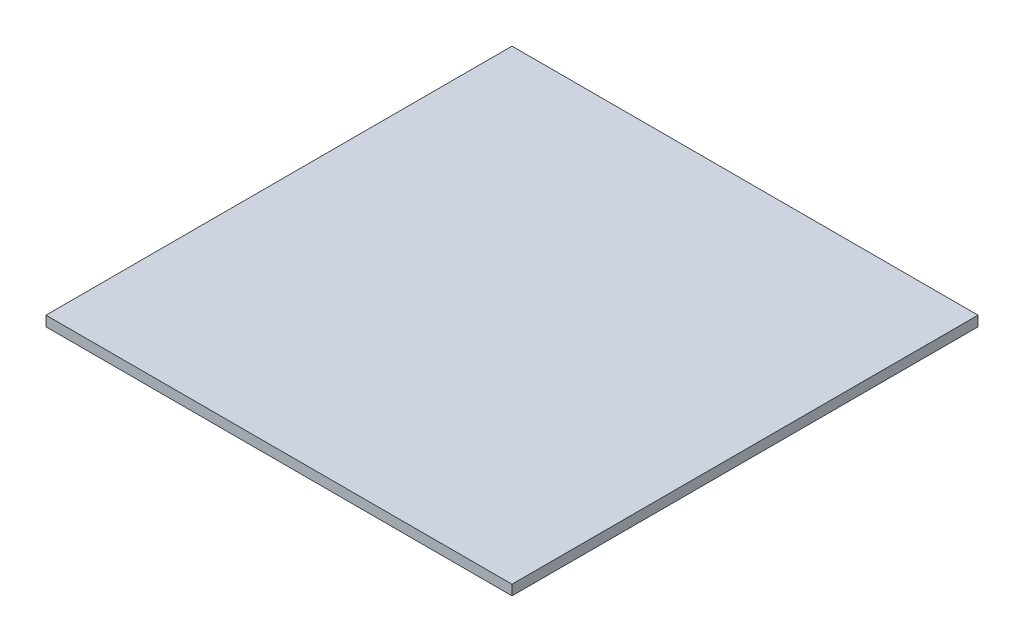
ISO-10303-21;
HEADER;
FILE_DESCRIPTION(('STEP AP214'),'2;1');
FILE_NAME('part.step','',(''),(''),'','','');
FILE_SCHEMA(('AUTOMOTIVE_DESIGN { 1 0 10303 214 1 1 1 1 }'));
ENDSEC;
DATA;
#1=APPLICATION_CONTEXT('core data for automotive mechanical design processes');
#2=APPLICATION_PROTOCOL_DEFINITION('international standard','automotive_design',2000,#1);
#3=PRODUCT_CONTEXT('',#1,'mechanical');
#4=PRODUCT('Part','Part','',(#3));
#5=PRODUCT_RELATED_PRODUCT_CATEGORY('part','',(#4));
#6=PRODUCT_DEFINITION_FORMATION('','',#4);
#7=PRODUCT_DEFINITION_CONTEXT('part definition',#1,'design');
#8=PRODUCT_DEFINITION('design','',#6,#7);
#9=PRODUCT_DEFINITION_SHAPE('','',#8);
#10=(LENGTH_UNIT() NAMED_UNIT(*) SI_UNIT(.MILLI.,.METRE.));
#11=(NAMED_UNIT(*) PLANE_ANGLE_UNIT() SI_UNIT($,.RADIAN.));
#12=(NAMED_UNIT(*) SI_UNIT($,.STERADIAN.) SOLID_ANGLE_UNIT());
#13=UNCERTAINTY_MEASURE_WITH_UNIT(LENGTH_MEASURE(1.E-05),#10,'distance_accuracy_value','');
#14=(GEOMETRIC_REPRESENTATION_CONTEXT(3) GLOBAL_UNCERTAINTY_ASSIGNED_CONTEXT((#13)) GLOBAL_UNIT_ASSIGNED_CONTEXT((#10,
#11,#12)) REPRESENTATION_CONTEXT('',''));
#15=CARTESIAN_POINT('',(0.,0.,0.));
#16=DIRECTION('',(0.,0.,1.));
#17=DIRECTION('',(1.,0.,0.));
#18=AXIS2_PLACEMENT_3D('',#15,#16,#17);
#19=CARTESIAN_POINT('',(-23.,1.,-23.));
#20=DIRECTION('',(1.,0.,0.));
#21=DIRECTION('',(0.,0.,-1.));
#22=AXIS2_PLACEMENT_3D('',#19,#20,#21);
#23=PLANE('',#22);
#24=DIRECTION('',(0.,0.,1.));
#25=VECTOR('',#24,1.);
#26=CARTESIAN_POINT('',(-23.,0.,-23.));
#27=LINE('',#26,#25);
#28=CARTESIAN_POINT('',(-23.,0.,-23.));
#29=VERTEX_POINT('',#28);
#30=CARTESIAN_POINT('',(-23.,0.,23.));
#31=VERTEX_POINT('',#30);
#32=EDGE_CURVE('E98',#29,#31,#27,.T.);
#33=ORIENTED_EDGE('',*,*,#32,.T.);
#34=DIRECTION('',(0.,-1.,0.));
#35=VECTOR('',#34,1.);
#36=CARTESIAN_POINT('',(-23.,1.,23.));
#37=LINE('',#36,#35);
#38=CARTESIAN_POINT('',(-23.,1.,23.));
#39=VERTEX_POINT('',#38);
#40=EDGE_CURVE('E11',#39,#31,#37,.T.);
#41=ORIENTED_EDGE('',*,*,#40,.F.);
#42=DIRECTION('',(0.,0.,1.));
#43=VECTOR('',#42,1.);
#44=CARTESIAN_POINT('',(-23.,1.,-23.));
#45=LINE('',#44,#43);
#46=CARTESIAN_POINT('',(-23.,1.,-23.));
#47=VERTEX_POINT('',#46);
#48=EDGE_CURVE('E86',#47,#39,#45,.T.);
#49=ORIENTED_EDGE('',*,*,#48,.F.);
#50=DIRECTION('',(0.,-1.,0.));
#51=VECTOR('',#50,1.);
#52=CARTESIAN_POINT('',(-23.,1.,-23.));
#53=LINE('',#52,#51);
#54=EDGE_CURVE('E94',#47,#29,#53,.T.);
#55=ORIENTED_EDGE('',*,*,#54,.T.);
#56=EDGE_LOOP('',(#33,#41,#49,#55));
#57=FACE_BOUND('',#56,.T.);
#58=ADVANCED_FACE('F35',(#57),#23,.F.);
#59=CARTESIAN_POINT('',(23.,1.,23.));
#60=DIRECTION('',(0.,0.,-1.));
#61=DIRECTION('',(-1.,0.,0.));
#62=AXIS2_PLACEMENT_3D('',#59,#60,#61);
#63=PLANE('',#62);
#64=DIRECTION('',(1.,0.,0.));
#65=VECTOR('',#64,1.);
#66=CARTESIAN_POINT('',(23.,0.,23.));
#67=LINE('',#66,#65);
#68=CARTESIAN_POINT('',(23.,0.,23.));
#69=VERTEX_POINT('',#68);
#70=EDGE_CURVE('E90',#31,#69,#67,.T.);
#71=ORIENTED_EDGE('',*,*,#70,.T.);
#72=DIRECTION('',(0.,-1.,0.));
#73=VECTOR('',#72,1.);
#74=CARTESIAN_POINT('',(23.,1.,23.));
#75=LINE('',#74,#73);
#76=CARTESIAN_POINT('',(23.,1.,23.));
#77=VERTEX_POINT('',#76);
#78=EDGE_CURVE('E43',#77,#69,#75,.T.);
#79=ORIENTED_EDGE('',*,*,#78,.F.);
#80=DIRECTION('',(1.,0.,0.));
#81=VECTOR('',#80,1.);
#82=CARTESIAN_POINT('',(23.,1.,23.));
#83=LINE('',#82,#81);
#84=EDGE_CURVE('E81',#39,#77,#83,.T.);
#85=ORIENTED_EDGE('',*,*,#84,.F.);
#86=ORIENTED_EDGE('',*,*,#40,.T.);
#87=EDGE_LOOP('',(#71,#79,#85,#86));
#88=FACE_BOUND('',#87,.T.);
#89=ADVANCED_FACE('F89',(#88),#63,.F.);
#90=CARTESIAN_POINT('',(23.,1.,-23.));
#91=DIRECTION('',(-1.,0.,0.));
#92=DIRECTION('',(0.,0.,1.));
#93=AXIS2_PLACEMENT_3D('',#90,#91,#92);
#94=PLANE('',#93);
#95=DIRECTION('',(0.,0.,-1.));
#96=VECTOR('',#95,1.);
#97=CARTESIAN_POINT('',(23.,0.,-23.));
#98=LINE('',#97,#96);
#99=CARTESIAN_POINT('',(23.,0.,-23.));
#100=VERTEX_POINT('',#99);
#101=EDGE_CURVE('E68',#69,#100,#98,.T.);
#102=ORIENTED_EDGE('',*,*,#101,.T.);
#103=DIRECTION('',(0.,-1.,0.));
#104=VECTOR('',#103,1.);
#105=CARTESIAN_POINT('',(23.,1.,-23.));
#106=LINE('',#105,#104);
#107=CARTESIAN_POINT('',(23.,1.,-23.));
#108=VERTEX_POINT('',#107);
#109=EDGE_CURVE('E91',#108,#100,#106,.T.);
#110=ORIENTED_EDGE('',*,*,#109,.F.);
#111=DIRECTION('',(0.,0.,-1.));
#112=VECTOR('',#111,1.);
#113=CARTESIAN_POINT('',(23.,1.,-23.));
#114=LINE('',#113,#112);
#115=EDGE_CURVE('E84',#77,#108,#114,.T.);
#116=ORIENTED_EDGE('',*,*,#115,.F.);
#117=ORIENTED_EDGE('',*,*,#78,.T.);
#118=EDGE_LOOP('',(#102,#110,#116,#117));
#119=FACE_BOUND('',#118,.T.);
#120=ADVANCED_FACE('F92',(#119),#94,.F.);
#121=CARTESIAN_POINT('',(23.,1.,-23.));
#122=DIRECTION('',(0.,0.,1.));
#123=DIRECTION('',(1.,0.,0.));
#124=AXIS2_PLACEMENT_3D('',#121,#122,#123);
#125=PLANE('',#124);
#126=DIRECTION('',(-1.,0.,0.));
#127=VECTOR('',#126,1.);
#128=CARTESIAN_POINT('',(23.,0.,-23.));
#129=LINE('',#128,#127);
#130=EDGE_CURVE('E74',#100,#29,#129,.T.);
#131=ORIENTED_EDGE('',*,*,#130,.T.);
#132=ORIENTED_EDGE('',*,*,#54,.F.);
#133=DIRECTION('',(-1.,0.,0.));
#134=VECTOR('',#133,1.);
#135=CARTESIAN_POINT('',(23.,1.,-23.));
#136=LINE('',#135,#134);
#137=EDGE_CURVE('E51',#108,#47,#136,.T.);
#138=ORIENTED_EDGE('',*,*,#137,.F.);
#139=ORIENTED_EDGE('',*,*,#109,.T.);
#140=EDGE_LOOP('',(#131,#132,#138,#139));
#141=FACE_BOUND('',#140,.T.);
#142=ADVANCED_FACE('F105',(#141),#125,.F.);
#143=CARTESIAN_POINT('',(0.,1.,0.));
#144=DIRECTION('',(0.,-1.,0.));
#145=DIRECTION('',(0.,0.,-1.));
#146=AXIS2_PLACEMENT_3D('',#143,#144,#145);
#147=PLANE('',#146);
#148=ORIENTED_EDGE('',*,*,#48,.T.);
#149=ORIENTED_EDGE('',*,*,#84,.T.);
#150=ORIENTED_EDGE('',*,*,#115,.T.);
#151=ORIENTED_EDGE('',*,*,#137,.T.);
#152=EDGE_LOOP('',(#148,#149,#150,#151));
#153=FACE_BOUND('',#152,.T.);
#154=ADVANCED_FACE('F82',(#153),#147,.F.);
#155=CARTESIAN_POINT('',(0.,0.,0.));
#156=DIRECTION('',(0.,-1.,0.));
#157=DIRECTION('',(0.,0.,-1.));
#158=AXIS2_PLACEMENT_3D('',#155,#156,#157);
#159=PLANE('',#158);
#160=ORIENTED_EDGE('',*,*,#32,.F.);
#161=ORIENTED_EDGE('',*,*,#130,.F.);
#162=ORIENTED_EDGE('',*,*,#101,.F.);
#163=ORIENTED_EDGE('',*,*,#70,.F.);
#164=EDGE_LOOP('',(#160,#161,#162,#163));
#165=FACE_BOUND('',#164,.T.);
#166=ADVANCED_FACE('F108',(#165),#159,.T.);
#167=CLOSED_SHELL('',(#58,#89,#120,#142,#154,#166));
#168=MANIFOLD_SOLID_BREP('B2',#167);
#169=ADVANCED_BREP_SHAPE_REPRESENTATION('',(#18,#168),#14);
#170=SHAPE_DEFINITION_REPRESENTATION(#9,#169);
ENDSEC;
END-ISO-10303-21;
